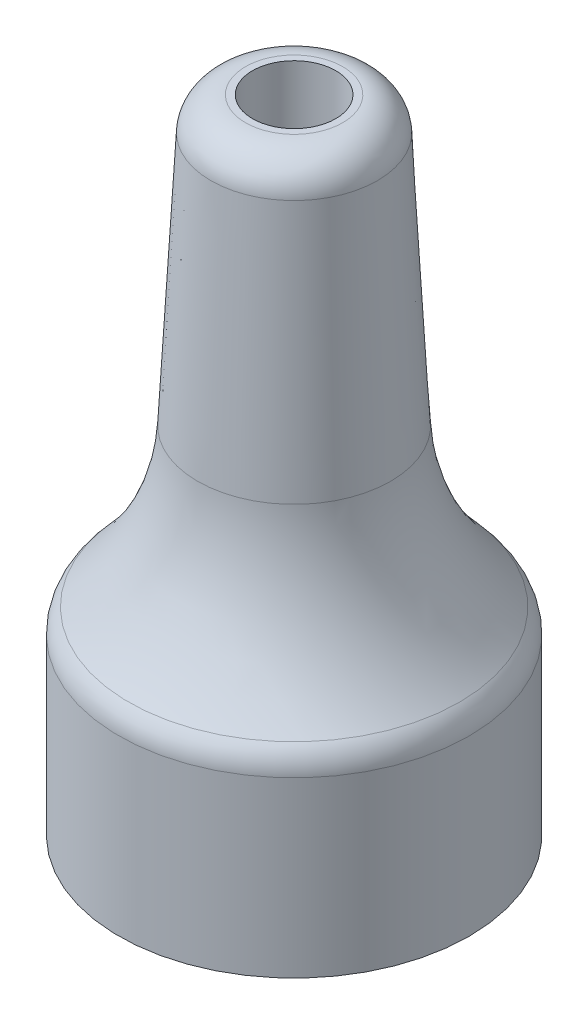
ISO-10303-21;
HEADER;
FILE_DESCRIPTION(('STEP AP214'),'2;1');
FILE_NAME('part.step','',(''),(''),'','','');
FILE_SCHEMA(('AUTOMOTIVE_DESIGN { 1 0 10303 214 1 1 1 1 }'));
ENDSEC;
DATA;
#1=APPLICATION_CONTEXT('core data for automotive mechanical design processes');
#2=APPLICATION_PROTOCOL_DEFINITION('international standard','automotive_design',2000,#1);
#3=PRODUCT_CONTEXT('',#1,'mechanical');
#4=PRODUCT('Part','Part','',(#3));
#5=PRODUCT_RELATED_PRODUCT_CATEGORY('part','',(#4));
#6=PRODUCT_DEFINITION_FORMATION('','',#4);
#7=PRODUCT_DEFINITION_CONTEXT('part definition',#1,'design');
#8=PRODUCT_DEFINITION('design','',#6,#7);
#9=PRODUCT_DEFINITION_SHAPE('','',#8);
#10=(LENGTH_UNIT() NAMED_UNIT(*) SI_UNIT(.MILLI.,.METRE.));
#11=(NAMED_UNIT(*) PLANE_ANGLE_UNIT() SI_UNIT($,.RADIAN.));
#12=(NAMED_UNIT(*) SI_UNIT($,.STERADIAN.) SOLID_ANGLE_UNIT());
#13=UNCERTAINTY_MEASURE_WITH_UNIT(LENGTH_MEASURE(1.E-05),#10,'distance_accuracy_value','');
#14=(GEOMETRIC_REPRESENTATION_CONTEXT(3) GLOBAL_UNCERTAINTY_ASSIGNED_CONTEXT((#13)) GLOBAL_UNIT_ASSIGNED_CONTEXT((#10,
#11,#12)) REPRESENTATION_CONTEXT('',''));
#15=CARTESIAN_POINT('',(0.,0.,0.));
#16=DIRECTION('',(0.,0.,1.));
#17=DIRECTION('',(1.,0.,0.));
#18=AXIS2_PLACEMENT_3D('',#15,#16,#17);
#19=CARTESIAN_POINT('',(-1.2,12.4828691844322,0.));
#20=DIRECTION('',(0.,-1.,0.));
#21=DIRECTION('',(1.,0.,0.));
#22=AXIS2_PLACEMENT_3D('',#19,#20,#21);
#23=PLANE('',#22);
#24=CARTESIAN_POINT('',(0.,12.4828691844322,0.));
#25=DIRECTION('',(0.,-1.,0.));
#26=DIRECTION('',(1.,0.,0.));
#27=AXIS2_PLACEMENT_3D('',#24,#25,#26);
#28=CIRCLE('',#27,1.40103543328507);
#29=CARTESIAN_POINT('',(1.40103543328503,12.4828691844322,0.));
#30=VERTEX_POINT('',#29);
#31=EDGE_CURVE('E43',#30,#30,#28,.F.);
#32=ORIENTED_EDGE('',*,*,#31,.T.);
#33=EDGE_LOOP('',(#32));
#34=FACE_BOUND('',#33,.T.);
#35=CARTESIAN_POINT('',(0.,12.4828691844321,0.));
#36=DIRECTION('',(0.,-1.,0.));
#37=DIRECTION('',(1.,0.,0.));
#38=AXIS2_PLACEMENT_3D('',#35,#36,#37);
#39=CIRCLE('',#38,1.19999999999996);
#40=CARTESIAN_POINT('',(1.19999999999991,12.4828691844321,0.));
#41=VERTEX_POINT('',#40);
#42=EDGE_CURVE('E67',#41,#41,#39,.T.);
#43=ORIENTED_EDGE('',*,*,#42,.T.);
#44=EDGE_LOOP('',(#43));
#45=FACE_BOUND('',#44,.T.);
#46=ADVANCED_FACE('F32',(#34,#45),#23,.F.);
#47=CARTESIAN_POINT('',(0.,12.4828691844321,0.));
#48=DIRECTION('',(0.,-1.,0.));
#49=DIRECTION('',(1.,0.,0.));
#50=AXIS2_PLACEMENT_3D('',#47,#48,#49);
#51=CONICAL_SURFACE('',#50,2.34999999999995,0.0523598775598304);
#52=CARTESIAN_POINT('',(0.,4.22329496435564,0.));
#53=DIRECTION('',(0.,1.,0.));
#54=DIRECTION('',(-1.,0.,0.));
#55=AXIS2_PLACEMENT_3D('',#52,#53,#54);
#56=CIRCLE('',#55,2.78286594269762);
#57=CARTESIAN_POINT('',(-2.78286594269764,4.22329496435563,0.));
#58=VERTEX_POINT('',#57);
#59=EDGE_CURVE('E10',#58,#58,#56,.T.);
#60=ORIENTED_EDGE('',*,*,#59,.T.);
#61=EDGE_LOOP('',(#60));
#62=FACE_BOUND('',#61,.T.);
#63=CARTESIAN_POINT('',(0.,11.5352051406751,0.));
#64=DIRECTION('',(0.,1.,0.));
#65=DIRECTION('',(-1.,0.,0.));
#66=AXIS2_PLACEMENT_3D('',#63,#64,#65);
#67=CIRCLE('',#66,2.39966496803964);
#68=CARTESIAN_POINT('',(-2.39966496803968,11.5352051406751,0.));
#69=VERTEX_POINT('',#68);
#70=EDGE_CURVE('E47',#69,#69,#67,.F.);
#71=ORIENTED_EDGE('',*,*,#70,.T.);
#72=EDGE_LOOP('',(#71));
#73=FACE_BOUND('',#72,.T.);
#74=ADVANCED_FACE('F99',(#62,#73),#51,.T.);
#75=CARTESIAN_POINT('',(3.43024899888577E-12,-1000.,0.));
#76=DIRECTION('',(0.,-1.,0.));
#77=DIRECTION('',(1.,0.,0.));
#78=AXIS2_PLACEMENT_3D('',#75,#76,#77);
#79=CYLINDRICAL_SURFACE('',#78,5.05000000000001);
#80=CARTESIAN_POINT('',(0.,-1.,0.));
#81=DIRECTION('',(0.,-1.,0.));
#82=DIRECTION('',(1.,0.,0.));
#83=AXIS2_PLACEMENT_3D('',#80,#81,#82);
#84=CIRCLE('',#83,5.05000000000001);
#85=CARTESIAN_POINT('',(5.05000000000001,-0.999999999999984,0.));
#86=VERTEX_POINT('',#85);
#87=EDGE_CURVE('E52',#86,#86,#84,.T.);
#88=ORIENTED_EDGE('',*,*,#87,.T.);
#89=EDGE_LOOP('',(#88));
#90=FACE_BOUND('',#89,.T.);
#91=CARTESIAN_POINT('',(0.,-6.00000000000001,0.));
#92=DIRECTION('',(0.,-1.,0.));
#93=DIRECTION('',(1.,0.,0.));
#94=AXIS2_PLACEMENT_3D('',#91,#92,#93);
#95=CIRCLE('',#94,5.05000000000002);
#96=CARTESIAN_POINT('',(5.05000000000004,-5.99999999999999,0.));
#97=VERTEX_POINT('',#96);
#98=EDGE_CURVE('E55',#97,#97,#95,.T.);
#99=ORIENTED_EDGE('',*,*,#98,.F.);
#100=EDGE_LOOP('',(#99));
#101=FACE_BOUND('',#100,.T.);
#102=ADVANCED_FACE('F94',(#90,#101),#79,.T.);
#103=CARTESIAN_POINT('',(-5.05,-6.,0.));
#104=DIRECTION('',(0.,1.,0.));
#105=DIRECTION('',(-1.,0.,0.));
#106=AXIS2_PLACEMENT_3D('',#103,#104,#105);
#107=PLANE('',#106);
#108=CARTESIAN_POINT('',(0.,-6.00000000000001,0.));
#109=DIRECTION('',(0.,-1.,0.));
#110=DIRECTION('',(1.,0.,0.));
#111=AXIS2_PLACEMENT_3D('',#108,#109,#110);
#112=CIRCLE('',#111,3.95000000000002);
#113=CARTESIAN_POINT('',(3.95000000000004,-5.99999999999999,0.));
#114=VERTEX_POINT('',#113);
#115=EDGE_CURVE('E58',#114,#114,#112,.T.);
#116=ORIENTED_EDGE('',*,*,#115,.F.);
#117=EDGE_LOOP('',(#116));
#118=FACE_BOUND('',#117,.T.);
#119=ORIENTED_EDGE('',*,*,#98,.T.);
#120=EDGE_LOOP('',(#119));
#121=FACE_BOUND('',#120,.T.);
#122=ADVANCED_FACE('F88',(#118,#121),#107,.F.);
#123=CARTESIAN_POINT('',(3.43024899888577E-12,-1000.,0.));
#124=DIRECTION('',(0.,-1.,0.));
#125=DIRECTION('',(1.,0.,0.));
#126=AXIS2_PLACEMENT_3D('',#123,#124,#125);
#127=CYLINDRICAL_SURFACE('',#126,3.95000000000001);
#128=CARTESIAN_POINT('',(0.,-1.,0.));
#129=DIRECTION('',(0.,-1.,0.));
#130=DIRECTION('',(1.,0.,0.));
#131=AXIS2_PLACEMENT_3D('',#128,#129,#130);
#132=CIRCLE('',#131,3.95);
#133=CARTESIAN_POINT('',(3.95000000000001,-0.999999999999987,0.));
#134=VERTEX_POINT('',#133);
#135=EDGE_CURVE('E61',#134,#134,#132,.T.);
#136=ORIENTED_EDGE('',*,*,#135,.F.);
#137=EDGE_LOOP('',(#136));
#138=FACE_BOUND('',#137,.T.);
#139=ORIENTED_EDGE('',*,*,#115,.T.);
#140=EDGE_LOOP('',(#139));
#141=FACE_BOUND('',#140,.T.);
#142=ADVANCED_FACE('F82',(#138,#141),#127,.F.);
#143=CARTESIAN_POINT('',(-3.95,-1.,0.));
#144=DIRECTION('',(0.,1.,0.));
#145=DIRECTION('',(-1.,0.,0.));
#146=AXIS2_PLACEMENT_3D('',#143,#144,#145);
#147=PLANE('',#146);
#148=CARTESIAN_POINT('',(0.,-1.,0.));
#149=DIRECTION('',(0.,-1.,0.));
#150=DIRECTION('',(1.,0.,0.));
#151=AXIS2_PLACEMENT_3D('',#148,#149,#150);
#152=CIRCLE('',#151,1.2);
#153=CARTESIAN_POINT('',(1.20000000000001,-0.999999999999997,0.));
#154=VERTEX_POINT('',#153);
#155=EDGE_CURVE('E64',#154,#154,#152,.T.);
#156=ORIENTED_EDGE('',*,*,#155,.F.);
#157=EDGE_LOOP('',(#156));
#158=FACE_BOUND('',#157,.T.);
#159=ORIENTED_EDGE('',*,*,#135,.T.);
#160=EDGE_LOOP('',(#159));
#161=FACE_BOUND('',#160,.T.);
#162=ADVANCED_FACE('F76',(#158,#161),#147,.F.);
#163=CARTESIAN_POINT('',(3.43024899888577E-12,-1000.,0.));
#164=DIRECTION('',(0.,-1.,0.));
#165=DIRECTION('',(1.,0.,0.));
#166=AXIS2_PLACEMENT_3D('',#163,#164,#165);
#167=CYLINDRICAL_SURFACE('',#166,1.19999999999998);
#168=ORIENTED_EDGE('',*,*,#42,.F.);
#169=EDGE_LOOP('',(#168));
#170=FACE_BOUND('',#169,.T.);
#171=ORIENTED_EDGE('',*,*,#155,.T.);
#172=EDGE_LOOP('',(#171));
#173=FACE_BOUND('',#172,.T.);
#174=ADVANCED_FACE('F72',(#170,#173),#167,.F.);
#175=CARTESIAN_POINT('',(0.,-1.,0.));
#176=DIRECTION('',(0.,-1.,0.));
#177=DIRECTION('',(1.,0.,0.));
#178=AXIS2_PLACEMENT_3D('',#175,#176,#177);
#179=TOROIDAL_SURFACE('',#178,4.05000000000001,1.);
#180=CARTESIAN_POINT('',(0.,-0.301294167742964,0.));
#181=DIRECTION('',(0.,-1.,0.));
#182=DIRECTION('',(1.,0.,0.));
#183=AXIS2_PLACEMENT_3D('',#180,#181,#182);
#184=CIRCLE('',#183,4.76540908574747);
#185=CARTESIAN_POINT('',(4.76540908574747,-0.301294167742947,0.));
#186=VERTEX_POINT('',#185);
#187=EDGE_CURVE('E39',#186,#186,#184,.T.);
#188=ORIENTED_EDGE('',*,*,#187,.T.);
#189=EDGE_LOOP('',(#188));
#190=FACE_BOUND('',#189,.T.);
#191=ORIENTED_EDGE('',*,*,#87,.F.);
#192=EDGE_LOOP('',(#191));
#193=FACE_BOUND('',#192,.T.);
#194=ADVANCED_FACE('F75',(#190,#193),#179,.T.);
#195=CARTESIAN_POINT('',(0.,11.4828691844322,0.));
#196=DIRECTION('',(0.,-1.,0.));
#197=DIRECTION('',(1.,0.,0.));
#198=AXIS2_PLACEMENT_3D('',#195,#196,#197);
#199=TOROIDAL_SURFACE('',#198,1.40103543328507,1.);
#200=ORIENTED_EDGE('',*,*,#31,.F.);
#201=EDGE_LOOP('',(#200));
#202=FACE_BOUND('',#201,.T.);
#203=ORIENTED_EDGE('',*,*,#70,.F.);
#204=EDGE_LOOP('',(#203));
#205=FACE_BOUND('',#204,.T.);
#206=ADVANCED_FACE('F113',(#202,#205),#199,.T.);
#207=CARTESIAN_POINT('',(0.,4.58964665805626,0.));
#208=DIRECTION('',(0.,-1.,0.));
#209=DIRECTION('',(1.,0.,0.));
#210=AXIS2_PLACEMENT_3D('',#207,#208,#209);
#211=TOROIDAL_SURFACE('',#210,9.77327268597964,7.);
#212=ORIENTED_EDGE('',*,*,#59,.F.);
#213=EDGE_LOOP('',(#212));
#214=FACE_BOUND('',#213,.T.);
#215=ORIENTED_EDGE('',*,*,#187,.F.);
#216=EDGE_LOOP('',(#215));
#217=FACE_BOUND('',#216,.T.);
#218=ADVANCED_FACE('F34',(#214,#217),#211,.F.);
#219=CLOSED_SHELL('',(#46,#74,#102,#122,#142,#162,#174,#194,#206,#218));
#220=MANIFOLD_SOLID_BREP('B2',#219);
#221=ADVANCED_BREP_SHAPE_REPRESENTATION('',(#18,#220),#14);
#222=SHAPE_DEFINITION_REPRESENTATION(#9,#221);
ENDSEC;
END-ISO-10303-21;
